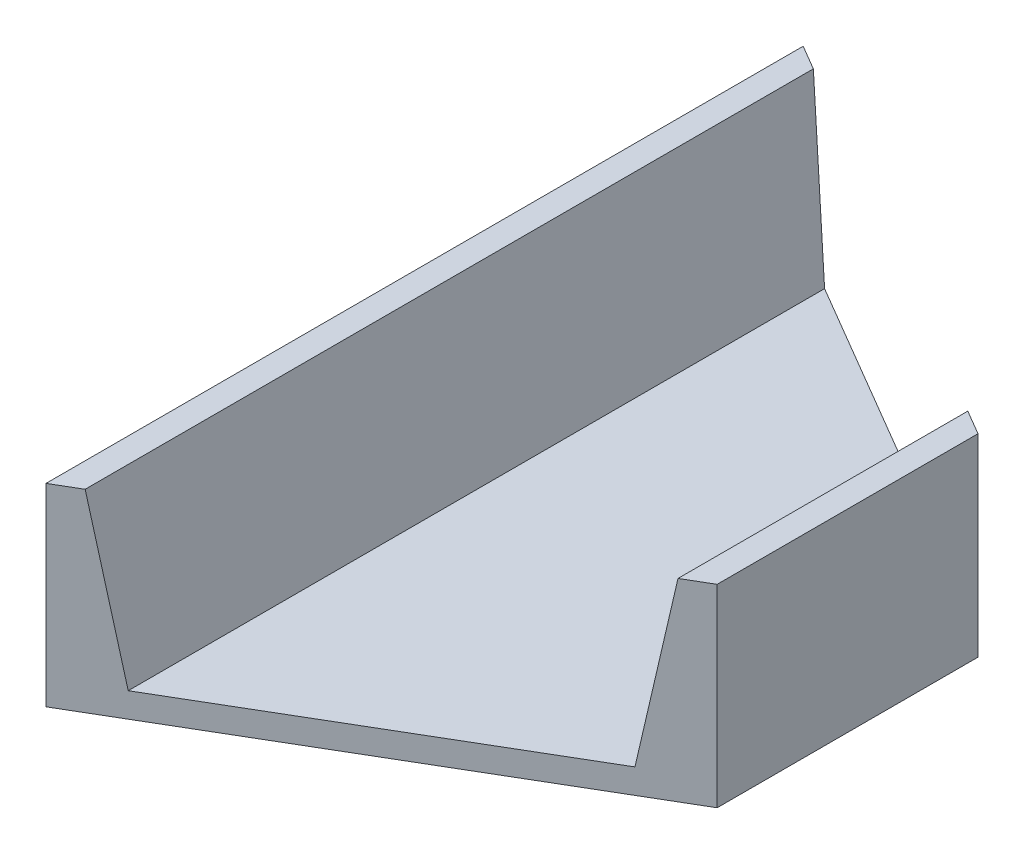
ISO-10303-21;
HEADER;
FILE_DESCRIPTION(('STEP AP214'),'2;1');
FILE_NAME('part.step','',(''),(''),'','','');
FILE_SCHEMA(('AUTOMOTIVE_DESIGN { 1 0 10303 214 1 1 1 1 }'));
ENDSEC;
DATA;
#1=APPLICATION_CONTEXT('core data for automotive mechanical design processes');
#2=APPLICATION_PROTOCOL_DEFINITION('international standard','automotive_design',2000,#1);
#3=PRODUCT_CONTEXT('',#1,'mechanical');
#4=PRODUCT('Part','Part','',(#3));
#5=PRODUCT_RELATED_PRODUCT_CATEGORY('part','',(#4));
#6=PRODUCT_DEFINITION_FORMATION('','',#4);
#7=PRODUCT_DEFINITION_CONTEXT('part definition',#1,'design');
#8=PRODUCT_DEFINITION('design','',#6,#7);
#9=PRODUCT_DEFINITION_SHAPE('','',#8);
#10=(LENGTH_UNIT() NAMED_UNIT(*) SI_UNIT(.MILLI.,.METRE.));
#11=(NAMED_UNIT(*) PLANE_ANGLE_UNIT() SI_UNIT($,.RADIAN.));
#12=(NAMED_UNIT(*) SI_UNIT($,.STERADIAN.) SOLID_ANGLE_UNIT());
#13=UNCERTAINTY_MEASURE_WITH_UNIT(LENGTH_MEASURE(1.E-05),#10,'distance_accuracy_value','');
#14=(GEOMETRIC_REPRESENTATION_CONTEXT(3) GLOBAL_UNCERTAINTY_ASSIGNED_CONTEXT((#13)) GLOBAL_UNIT_ASSIGNED_CONTEXT((#10,
#11,#12)) REPRESENTATION_CONTEXT('',''));
#15=CARTESIAN_POINT('',(0.,0.,0.));
#16=DIRECTION('',(0.,0.,1.));
#17=DIRECTION('',(1.,0.,0.));
#18=AXIS2_PLACEMENT_3D('',#15,#16,#17);
#19=CARTESIAN_POINT('',(-38.1,17.43075,136.398));
#20=DIRECTION('',(1.,0.,0.));
#21=DIRECTION('',(0.,0.,-1.));
#22=AXIS2_PLACEMENT_3D('',#19,#20,#21);
#23=PLANE('',#22);
#24=DIRECTION('',(0.,-1.,0.));
#25=VECTOR('',#24,1.);
#26=CARTESIAN_POINT('',(-38.1,17.43075,0.));
#27=LINE('',#26,#25);
#28=CARTESIAN_POINT('',(-38.1,17.43075,0.));
#29=VERTEX_POINT('',#28);
#30=CARTESIAN_POINT('',(-38.1,-17.43075,0.));
#31=VERTEX_POINT('',#30);
#32=EDGE_CURVE('E128',#29,#31,#27,.T.);
#33=ORIENTED_EDGE('',*,*,#32,.T.);
#34=DIRECTION('',(0.,0.,-1.));
#35=VECTOR('',#34,1.);
#36=CARTESIAN_POINT('',(-38.1,-17.43075,136.398));
#37=LINE('',#36,#35);
#38=CARTESIAN_POINT('',(-38.1,-17.43075,136.398));
#39=VERTEX_POINT('',#38);
#40=EDGE_CURVE('E11',#39,#31,#37,.T.);
#41=ORIENTED_EDGE('',*,*,#40,.F.);
#42=DIRECTION('',(0.,-1.,0.));
#43=VECTOR('',#42,1.);
#44=CARTESIAN_POINT('',(-38.1,17.43075,136.398));
#45=LINE('',#44,#43);
#46=CARTESIAN_POINT('',(-38.1,17.43075,136.398));
#47=VERTEX_POINT('',#46);
#48=EDGE_CURVE('E127',#47,#39,#45,.T.);
#49=ORIENTED_EDGE('',*,*,#48,.F.);
#50=DIRECTION('',(0.,0.,-1.));
#51=VECTOR('',#50,1.);
#52=CARTESIAN_POINT('',(-38.1,17.43075,136.398));
#53=LINE('',#52,#51);
#54=EDGE_CURVE('E124',#47,#29,#53,.T.);
#55=ORIENTED_EDGE('',*,*,#54,.T.);
#56=EDGE_LOOP('',(#33,#41,#49,#55));
#57=FACE_BOUND('',#56,.T.);
#58=ADVANCED_FACE('F33',(#57),#23,.F.);
#59=CARTESIAN_POINT('',(38.1,-17.43075,136.398));
#60=DIRECTION('',(0.,1.,0.));
#61=DIRECTION('',(-1.,0.,0.));
#62=AXIS2_PLACEMENT_3D('',#59,#60,#61);
#63=PLANE('',#62);
#64=DIRECTION('',(0.,0.,-1.));
#65=VECTOR('',#64,1.);
#66=CARTESIAN_POINT('',(38.1,-17.43075,136.398));
#67=LINE('',#66,#65);
#68=CARTESIAN_POINT('',(38.1,-17.43075,91.694));
#69=VERTEX_POINT('',#68);
#70=CARTESIAN_POINT('',(38.1,-17.43075,44.704));
#71=VERTEX_POINT('',#70);
#72=EDGE_CURVE('E41',#69,#71,#67,.T.);
#73=ORIENTED_EDGE('',*,*,#72,.F.);
#74=DIRECTION('',(-0.862524905766236,0.,0.506014611382859));
#75=VECTOR('',#74,1.);
#76=CARTESIAN_POINT('',(-38.1,-17.43075,136.398));
#77=LINE('',#76,#75);
#78=EDGE_CURVE('E97',#69,#39,#77,.T.);
#79=ORIENTED_EDGE('',*,*,#78,.T.);
#80=ORIENTED_EDGE('',*,*,#40,.T.);
#81=DIRECTION('',(0.862524905766236,0.,0.506014611382859));
#82=VECTOR('',#81,1.);
#83=CARTESIAN_POINT('',(-38.1,-17.43075,0.));
#84=LINE('',#83,#82);
#85=EDGE_CURVE('E142',#31,#71,#84,.T.);
#86=ORIENTED_EDGE('',*,*,#85,.T.);
#87=EDGE_LOOP('',(#73,#79,#80,#86));
#88=FACE_BOUND('',#87,.T.);
#89=ADVANCED_FACE('F158',(#88),#63,.F.);
#90=CARTESIAN_POINT('',(38.1,17.43075,136.398));
#91=DIRECTION('',(-1.,0.,0.));
#92=DIRECTION('',(0.,0.,1.));
#93=AXIS2_PLACEMENT_3D('',#90,#91,#92);
#94=PLANE('',#93);
#95=DIRECTION('',(0.,0.,-1.));
#96=VECTOR('',#95,1.);
#97=CARTESIAN_POINT('',(38.1,17.43075,136.398));
#98=LINE('',#97,#96);
#99=CARTESIAN_POINT('',(38.1,17.43075,91.694));
#100=VERTEX_POINT('',#99);
#101=CARTESIAN_POINT('',(38.1,17.43075,44.704));
#102=VERTEX_POINT('',#101);
#103=EDGE_CURVE('E107',#100,#102,#98,.T.);
#104=ORIENTED_EDGE('',*,*,#103,.F.);
#105=DIRECTION('',(0.,1.,0.));
#106=VECTOR('',#105,1.);
#107=CARTESIAN_POINT('',(38.1,-17.43075,91.694));
#108=LINE('',#107,#106);
#109=EDGE_CURVE('E91',#69,#100,#108,.T.);
#110=ORIENTED_EDGE('',*,*,#109,.F.);
#111=ORIENTED_EDGE('',*,*,#72,.T.);
#112=DIRECTION('',(0.,1.,0.));
#113=VECTOR('',#112,1.);
#114=CARTESIAN_POINT('',(38.1,-17.43075,44.704));
#115=LINE('',#114,#113);
#116=EDGE_CURVE('E114',#71,#102,#115,.T.);
#117=ORIENTED_EDGE('',*,*,#116,.T.);
#118=EDGE_LOOP('',(#104,#110,#111,#117));
#119=FACE_BOUND('',#118,.T.);
#120=ADVANCED_FACE('F112',(#119),#94,.F.);
#121=CARTESIAN_POINT('',(33.655,17.43075,136.398));
#122=DIRECTION('',(0.,-1.,0.));
#123=DIRECTION('',(0.,0.,-1.));
#124=AXIS2_PLACEMENT_3D('',#121,#122,#123);
#125=PLANE('',#124);
#126=DIRECTION('',(0.,0.,-1.));
#127=VECTOR('',#126,1.);
#128=CARTESIAN_POINT('',(33.655,17.43075,136.398));
#129=LINE('',#128,#127);
#130=CARTESIAN_POINT('',(33.655,17.43075,94.3017333333333));
#131=VERTEX_POINT('',#130);
#132=CARTESIAN_POINT('',(33.655,17.43075,42.0962666666667));
#133=VERTEX_POINT('',#132);
#134=EDGE_CURVE('E109',#131,#133,#129,.T.);
#135=ORIENTED_EDGE('',*,*,#134,.F.);
#136=DIRECTION('',(-0.862524905766236,0.,0.506014611382859));
#137=VECTOR('',#136,1.);
#138=CARTESIAN_POINT('',(-38.1,17.43075,136.398));
#139=LINE('',#138,#137);
#140=EDGE_CURVE('E94',#100,#131,#139,.T.);
#141=ORIENTED_EDGE('',*,*,#140,.F.);
#142=ORIENTED_EDGE('',*,*,#103,.T.);
#143=DIRECTION('',(0.862524905766236,0.,0.506014611382859));
#144=VECTOR('',#143,1.);
#145=CARTESIAN_POINT('',(-38.1,17.43075,0.));
#146=LINE('',#145,#144);
#147=EDGE_CURVE('E148',#133,#102,#146,.T.);
#148=ORIENTED_EDGE('',*,*,#147,.F.);
#149=EDGE_LOOP('',(#135,#141,#142,#148));
#150=FACE_BOUND('',#149,.T.);
#151=ADVANCED_FACE('F105',(#150),#125,.F.);
#152=CARTESIAN_POINT('',(28.7655,-12.98575,136.398));
#153=DIRECTION('',(0.987324604076944,-0.158713976020719,0.));
#154=DIRECTION('',(0.15871397602072,0.987324604076944,0.));
#155=AXIS2_PLACEMENT_3D('',#152,#153,#154);
#156=PLANE('',#155);
#157=DIRECTION('',(0.,0.,-1.));
#158=VECTOR('',#157,1.);
#159=CARTESIAN_POINT('',(28.7655,-12.98575,136.398));
#160=LINE('',#159,#158);
#161=CARTESIAN_POINT('',(28.7655,-12.98575,97.17024));
#162=VERTEX_POINT('',#161);
#163=CARTESIAN_POINT('',(28.7655,-12.98575,39.22776));
#164=VERTEX_POINT('',#163);
#165=EDGE_CURVE('E116',#162,#164,#160,.T.);
#166=ORIENTED_EDGE('',*,*,#165,.F.);
#167=DIRECTION('',(0.158030402008212,0.983072241064075,-0.0927111691781512));
#168=VECTOR('',#167,1.);
#169=CARTESIAN_POINT('',(28.1907668963843,-16.5610377484664,97.5074167541212));
#170=LINE('',#169,#168);
#171=EDGE_CURVE('E149',#162,#131,#170,.T.);
#172=ORIENTED_EDGE('',*,*,#171,.T.);
#173=ORIENTED_EDGE('',*,*,#134,.T.);
#174=DIRECTION('',(-0.158030402008212,-0.983072241064075,-0.0927111691781512));
#175=VECTOR('',#174,1.);
#176=CARTESIAN_POINT('',(30.1891590010309,-4.12948166891144,40.0629732806048));
#177=LINE('',#176,#175);
#178=EDGE_CURVE('E131',#133,#164,#177,.T.);
#179=ORIENTED_EDGE('',*,*,#178,.T.);
#180=EDGE_LOOP('',(#166,#172,#173,#179));
#181=FACE_BOUND('',#180,.T.);
#182=ADVANCED_FACE('F177',(#181),#156,.F.);
#183=CARTESIAN_POINT('',(-28.7655,-12.98575,136.398));
#184=DIRECTION('',(0.,-1.,0.));
#185=DIRECTION('',(0.,0.,-1.));
#186=AXIS2_PLACEMENT_3D('',#183,#184,#185);
#187=PLANE('',#186);
#188=DIRECTION('',(0.,0.,-1.));
#189=VECTOR('',#188,1.);
#190=CARTESIAN_POINT('',(-28.7655,-12.98575,136.398));
#191=LINE('',#190,#189);
#192=CARTESIAN_POINT('',(-28.7655,-12.98575,130.92176));
#193=VERTEX_POINT('',#192);
#194=CARTESIAN_POINT('',(-28.7655,-12.98575,5.47623999999999));
#195=VERTEX_POINT('',#194);
#196=EDGE_CURVE('E120',#193,#195,#191,.T.);
#197=ORIENTED_EDGE('',*,*,#196,.F.);
#198=DIRECTION('',(0.862524905766236,0.,-0.506014611382859));
#199=VECTOR('',#198,1.);
#200=CARTESIAN_POINT('',(-31.1556060706256,-12.98575,132.323955561434));
#201=LINE('',#200,#199);
#202=EDGE_CURVE('E151',#193,#162,#201,.T.);
#203=ORIENTED_EDGE('',*,*,#202,.T.);
#204=ORIENTED_EDGE('',*,*,#165,.T.);
#205=DIRECTION('',(-0.862524905766236,0.,-0.506014611382859));
#206=VECTOR('',#205,1.);
#207=CARTESIAN_POINT('',(28.3753289908742,-12.98575,38.9988596746462));
#208=LINE('',#207,#206);
#209=EDGE_CURVE('E135',#164,#195,#208,.T.);
#210=ORIENTED_EDGE('',*,*,#209,.T.);
#211=EDGE_LOOP('',(#197,#203,#204,#210));
#212=FACE_BOUND('',#211,.T.);
#213=ADVANCED_FACE('F174',(#212),#187,.F.);
#214=CARTESIAN_POINT('',(-33.655,17.43075,136.398));
#215=DIRECTION('',(-0.987324604076944,-0.15871397602072,0.));
#216=DIRECTION('',(0.15871397602072,-0.987324604076944,0.));
#217=AXIS2_PLACEMENT_3D('',#214,#215,#216);
#218=PLANE('',#217);
#219=DIRECTION('',(0.,0.,-1.));
#220=VECTOR('',#219,1.);
#221=CARTESIAN_POINT('',(-33.655,17.43075,136.398));
#222=LINE('',#221,#220);
#223=CARTESIAN_POINT('',(-33.655,17.43075,133.790266666667));
#224=VERTEX_POINT('',#223);
#225=CARTESIAN_POINT('',(-33.655,17.43075,2.60773333333334));
#226=VERTEX_POINT('',#225);
#227=EDGE_CURVE('E122',#224,#226,#222,.T.);
#228=ORIENTED_EDGE('',*,*,#227,.F.);
#229=DIRECTION('',(0.158030402008213,-0.983072241064075,-0.0927111691781514));
#230=VECTOR('',#229,1.);
#231=CARTESIAN_POINT('',(-33.6932063791577,17.6684234495657,133.812681075773));
#232=LINE('',#231,#230);
#233=EDGE_CURVE('E101',#224,#193,#232,.T.);
#234=ORIENTED_EDGE('',*,*,#233,.T.);
#235=ORIENTED_EDGE('',*,*,#196,.T.);
#236=DIRECTION('',(-0.158030402008213,0.983072241064075,-0.0927111691781514));
#237=VECTOR('',#236,1.);
#238=CARTESIAN_POINT('',(-31.6948142745111,5.23686737001064,3.75770895895347));
#239=LINE('',#238,#237);
#240=EDGE_CURVE('E138',#195,#226,#239,.T.);
#241=ORIENTED_EDGE('',*,*,#240,.T.);
#242=EDGE_LOOP('',(#228,#234,#235,#241));
#243=FACE_BOUND('',#242,.T.);
#244=ADVANCED_FACE('F169',(#243),#218,.F.);
#245=CARTESIAN_POINT('',(-38.1,17.43075,136.398));
#246=DIRECTION('',(0.,-1.,0.));
#247=DIRECTION('',(0.,0.,-1.));
#248=AXIS2_PLACEMENT_3D('',#245,#246,#247);
#249=PLANE('',#248);
#250=ORIENTED_EDGE('',*,*,#54,.F.);
#251=EDGE_CURVE('E47',#224,#47,#139,.T.);
#252=ORIENTED_EDGE('',*,*,#251,.F.);
#253=ORIENTED_EDGE('',*,*,#227,.T.);
#254=EDGE_CURVE('E145',#29,#226,#146,.T.);
#255=ORIENTED_EDGE('',*,*,#254,.F.);
#256=EDGE_LOOP('',(#250,#252,#253,#255));
#257=FACE_BOUND('',#256,.T.);
#258=ADVANCED_FACE('F166',(#257),#249,.F.);
#259=CARTESIAN_POINT('',(-38.1,-17.43075,0.));
#260=DIRECTION('',(-0.506014611382859,0.,0.862524905766236));
#261=DIRECTION('',(0.862524905766236,0.,0.506014611382859));
#262=AXIS2_PLACEMENT_3D('',#259,#260,#261);
#263=PLANE('',#262);
#264=ORIENTED_EDGE('',*,*,#147,.T.);
#265=ORIENTED_EDGE('',*,*,#116,.F.);
#266=ORIENTED_EDGE('',*,*,#85,.F.);
#267=ORIENTED_EDGE('',*,*,#32,.F.);
#268=ORIENTED_EDGE('',*,*,#254,.T.);
#269=ORIENTED_EDGE('',*,*,#240,.F.);
#270=ORIENTED_EDGE('',*,*,#209,.F.);
#271=ORIENTED_EDGE('',*,*,#178,.F.);
#272=EDGE_LOOP('',(#264,#265,#266,#267,#268,#269,#270,#271));
#273=FACE_BOUND('',#272,.T.);
#274=ADVANCED_FACE('F163',(#273),#263,.F.);
#275=CARTESIAN_POINT('',(-38.1,-17.43075,136.398));
#276=DIRECTION('',(-0.506014611382859,0.,-0.862524905766236));
#277=DIRECTION('',(-0.862524905766236,0.,0.506014611382859));
#278=AXIS2_PLACEMENT_3D('',#275,#276,#277);
#279=PLANE('',#278);
#280=ORIENTED_EDGE('',*,*,#202,.F.);
#281=ORIENTED_EDGE('',*,*,#233,.F.);
#282=ORIENTED_EDGE('',*,*,#251,.T.);
#283=ORIENTED_EDGE('',*,*,#48,.T.);
#284=ORIENTED_EDGE('',*,*,#78,.F.);
#285=ORIENTED_EDGE('',*,*,#109,.T.);
#286=ORIENTED_EDGE('',*,*,#140,.T.);
#287=ORIENTED_EDGE('',*,*,#171,.F.);
#288=EDGE_LOOP('',(#280,#281,#282,#283,#284,#285,#286,#287));
#289=FACE_BOUND('',#288,.T.);
#290=ADVANCED_FACE('F93',(#289),#279,.F.);
#291=CLOSED_SHELL('',(#58,#89,#120,#151,#182,#213,#244,#258,#274,#290));
#292=MANIFOLD_SOLID_BREP('B2',#291);
#293=ADVANCED_BREP_SHAPE_REPRESENTATION('',(#18,#292),#14);
#294=SHAPE_DEFINITION_REPRESENTATION(#9,#293);
ENDSEC;
END-ISO-10303-21;
